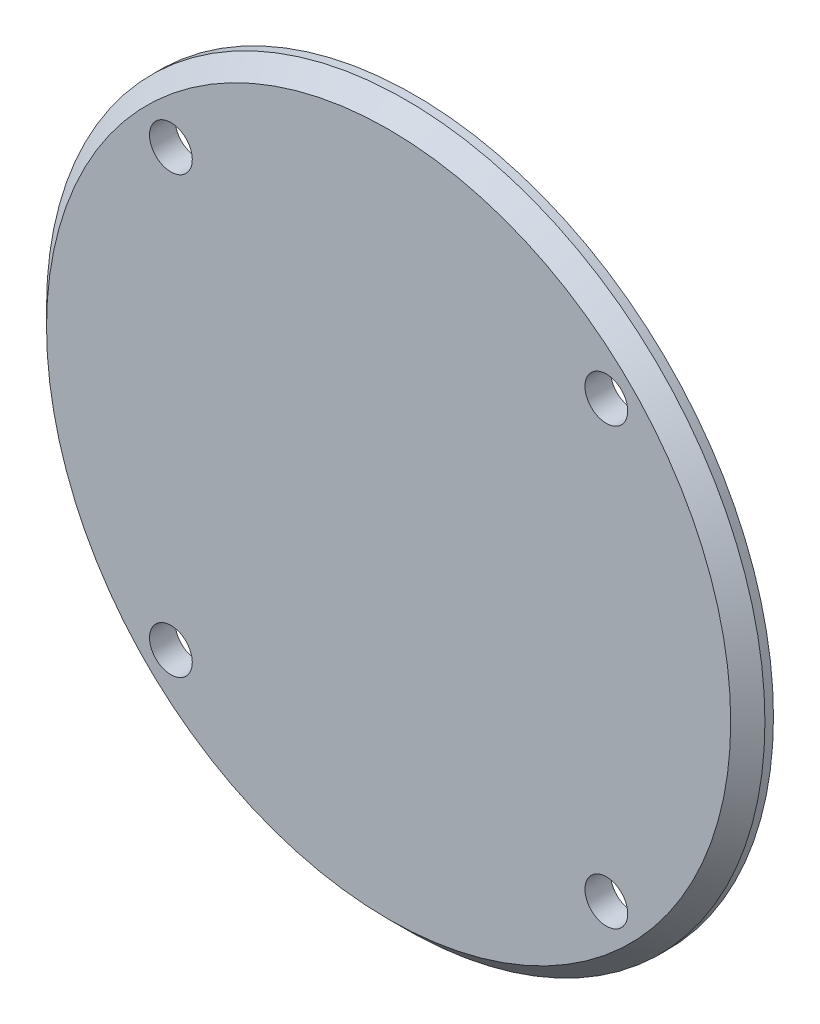
ISO-10303-21;
HEADER;
FILE_DESCRIPTION(('STEP AP214'),'2;1');
FILE_NAME('part.step','',(''),(''),'','','');
FILE_SCHEMA(('AUTOMOTIVE_DESIGN { 1 0 10303 214 1 1 1 1 }'));
ENDSEC;
DATA;
#1=APPLICATION_CONTEXT('core data for automotive mechanical design processes');
#2=APPLICATION_PROTOCOL_DEFINITION('international standard','automotive_design',2000,#1);
#3=PRODUCT_CONTEXT('',#1,'mechanical');
#4=PRODUCT('Part','Part','',(#3));
#5=PRODUCT_RELATED_PRODUCT_CATEGORY('part','',(#4));
#6=PRODUCT_DEFINITION_FORMATION('','',#4);
#7=PRODUCT_DEFINITION_CONTEXT('part definition',#1,'design');
#8=PRODUCT_DEFINITION('design','',#6,#7);
#9=PRODUCT_DEFINITION_SHAPE('','',#8);
#10=(LENGTH_UNIT() NAMED_UNIT(*) SI_UNIT(.MILLI.,.METRE.));
#11=(NAMED_UNIT(*) PLANE_ANGLE_UNIT() SI_UNIT($,.RADIAN.));
#12=(NAMED_UNIT(*) SI_UNIT($,.STERADIAN.) SOLID_ANGLE_UNIT());
#13=UNCERTAINTY_MEASURE_WITH_UNIT(LENGTH_MEASURE(1.E-05),#10,'distance_accuracy_value','');
#14=(GEOMETRIC_REPRESENTATION_CONTEXT(3) GLOBAL_UNCERTAINTY_ASSIGNED_CONTEXT((#13)) GLOBAL_UNIT_ASSIGNED_CONTEXT((#10,
#11,#12)) REPRESENTATION_CONTEXT('',''));
#15=CARTESIAN_POINT('',(0.,0.,0.));
#16=DIRECTION('',(0.,0.,1.));
#17=DIRECTION('',(1.,0.,0.));
#18=AXIS2_PLACEMENT_3D('',#15,#16,#17);
#19=CARTESIAN_POINT('',(0.,0.,143.95));
#20=DIRECTION('',(0.,0.,-1.));
#21=DIRECTION('',(-1.,0.,0.));
#22=AXIS2_PLACEMENT_3D('',#19,#20,#21);
#23=CYLINDRICAL_SURFACE('',#22,42.);
#24=CARTESIAN_POINT('',(0.,0.,141.95));
#25=DIRECTION('',(0.,0.,1.));
#26=DIRECTION('',(1.,0.,0.));
#27=AXIS2_PLACEMENT_3D('',#24,#25,#26);
#28=CIRCLE('',#27,42.);
#29=CARTESIAN_POINT('',(42.,0.,141.95));
#30=VERTEX_POINT('',#29);
#31=EDGE_CURVE('E10',#30,#30,#28,.F.);
#32=ORIENTED_EDGE('',*,*,#31,.T.);
#33=EDGE_LOOP('',(#32));
#34=FACE_BOUND('',#33,.T.);
#35=CARTESIAN_POINT('',(0.,0.,140.95));
#36=DIRECTION('',(0.,0.,1.));
#37=DIRECTION('',(1.,0.,0.));
#38=AXIS2_PLACEMENT_3D('',#35,#36,#37);
#39=CIRCLE('',#38,42.);
#40=CARTESIAN_POINT('',(42.,0.,140.95));
#41=VERTEX_POINT('',#40);
#42=EDGE_CURVE('E46',#41,#41,#39,.T.);
#43=ORIENTED_EDGE('',*,*,#42,.T.);
#44=EDGE_LOOP('',(#43));
#45=FACE_BOUND('',#44,.T.);
#46=ADVANCED_FACE('F34',(#34,#45),#23,.T.);
#47=CARTESIAN_POINT('',(0.,0.,143.95));
#48=DIRECTION('',(0.,0.,1.));
#49=DIRECTION('',(1.,0.,0.));
#50=AXIS2_PLACEMENT_3D('',#47,#48,#49);
#51=PLANE('',#50);
#52=CARTESIAN_POINT('',(0.,0.,143.95));
#53=DIRECTION('',(0.,0.,1.));
#54=DIRECTION('',(1.,0.,0.));
#55=AXIS2_PLACEMENT_3D('',#52,#53,#54);
#56=CIRCLE('',#55,40.);
#57=CARTESIAN_POINT('',(40.,0.,143.95));
#58=VERTEX_POINT('',#57);
#59=EDGE_CURVE('E42',#58,#58,#56,.T.);
#60=ORIENTED_EDGE('',*,*,#59,.T.);
#61=EDGE_LOOP('',(#60));
#62=FACE_BOUND('',#61,.T.);
#63=CARTESIAN_POINT('',(-25.4558441227155,25.4558441227159,143.95));
#64=DIRECTION('',(0.,0.,1.));
#65=DIRECTION('',(0.,-1.,0.));
#66=AXIS2_PLACEMENT_3D('',#63,#64,#65);
#67=CIRCLE('',#66,2.5);
#68=CARTESIAN_POINT('',(-25.4558441227155,22.9558441227159,143.95));
#69=VERTEX_POINT('',#68);
#70=EDGE_CURVE('E69',#69,#69,#67,.T.);
#71=ORIENTED_EDGE('',*,*,#70,.F.);
#72=EDGE_LOOP('',(#71));
#73=FACE_BOUND('',#72,.T.);
#74=CARTESIAN_POINT('',(25.4558441227158,25.4558441227156,143.95));
#75=DIRECTION('',(0.,0.,1.));
#76=DIRECTION('',(-1.,0.,0.));
#77=AXIS2_PLACEMENT_3D('',#74,#75,#76);
#78=CIRCLE('',#77,2.5);
#79=CARTESIAN_POINT('',(22.9558441227158,25.4558441227156,143.95));
#80=VERTEX_POINT('',#79);
#81=EDGE_CURVE('E62',#80,#80,#78,.T.);
#82=ORIENTED_EDGE('',*,*,#81,.F.);
#83=EDGE_LOOP('',(#82));
#84=FACE_BOUND('',#83,.T.);
#85=CARTESIAN_POINT('',(25.4558441227153,-25.4558441227161,143.95));
#86=DIRECTION('',(0.,0.,1.));
#87=DIRECTION('',(0.,1.,0.));
#88=AXIS2_PLACEMENT_3D('',#85,#86,#87);
#89=CIRCLE('',#88,2.5);
#90=CARTESIAN_POINT('',(25.4558441227153,-22.9558441227161,143.95));
#91=VERTEX_POINT('',#90);
#92=EDGE_CURVE('E63',#91,#91,#89,.T.);
#93=ORIENTED_EDGE('',*,*,#92,.F.);
#94=EDGE_LOOP('',(#93));
#95=FACE_BOUND('',#94,.T.);
#96=CARTESIAN_POINT('',(-25.4558441227158,-25.4558441227156,143.95));
#97=DIRECTION('',(0.,0.,1.));
#98=DIRECTION('',(1.,0.,0.));
#99=AXIS2_PLACEMENT_3D('',#96,#97,#98);
#100=CIRCLE('',#99,2.5);
#101=CARTESIAN_POINT('',(-22.9558441227158,-25.4558441227156,143.95));
#102=VERTEX_POINT('',#101);
#103=EDGE_CURVE('E54',#102,#102,#100,.T.);
#104=ORIENTED_EDGE('',*,*,#103,.F.);
#105=EDGE_LOOP('',(#104));
#106=FACE_BOUND('',#105,.T.);
#107=ADVANCED_FACE('F80',(#62,#73,#84,#95,#106),#51,.T.);
#108=CARTESIAN_POINT('',(0.,0.,140.95));
#109=DIRECTION('',(0.,0.,1.));
#110=DIRECTION('',(1.,0.,0.));
#111=AXIS2_PLACEMENT_3D('',#108,#109,#110);
#112=PLANE('',#111);
#113=CARTESIAN_POINT('',(-25.4558441227155,25.4558441227159,140.95));
#114=DIRECTION('',(0.,0.,1.));
#115=DIRECTION('',(0.,-1.,0.));
#116=AXIS2_PLACEMENT_3D('',#113,#114,#115);
#117=CIRCLE('',#116,2.5);
#118=CARTESIAN_POINT('',(-25.4558441227155,22.9558441227159,140.95));
#119=VERTEX_POINT('',#118);
#120=EDGE_CURVE('E58',#119,#119,#117,.F.);
#121=ORIENTED_EDGE('',*,*,#120,.F.);
#122=EDGE_LOOP('',(#121));
#123=FACE_BOUND('',#122,.T.);
#124=CARTESIAN_POINT('',(25.4558441227158,25.4558441227156,140.95));
#125=DIRECTION('',(0.,0.,1.));
#126=DIRECTION('',(-1.,0.,0.));
#127=AXIS2_PLACEMENT_3D('',#124,#125,#126);
#128=CIRCLE('',#127,2.5);
#129=CARTESIAN_POINT('',(22.9558441227158,25.4558441227156,140.95));
#130=VERTEX_POINT('',#129);
#131=EDGE_CURVE('E66',#130,#130,#128,.F.);
#132=ORIENTED_EDGE('',*,*,#131,.F.);
#133=EDGE_LOOP('',(#132));
#134=FACE_BOUND('',#133,.T.);
#135=CARTESIAN_POINT('',(25.4558441227153,-25.4558441227161,140.95));
#136=DIRECTION('',(0.,0.,1.));
#137=DIRECTION('',(0.,1.,0.));
#138=AXIS2_PLACEMENT_3D('',#135,#136,#137);
#139=CIRCLE('',#138,2.5);
#140=CARTESIAN_POINT('',(25.4558441227153,-22.9558441227161,140.95));
#141=VERTEX_POINT('',#140);
#142=EDGE_CURVE('E59',#141,#141,#139,.F.);
#143=ORIENTED_EDGE('',*,*,#142,.F.);
#144=EDGE_LOOP('',(#143));
#145=FACE_BOUND('',#144,.T.);
#146=CARTESIAN_POINT('',(-25.4558441227158,-25.4558441227156,140.95));
#147=DIRECTION('',(0.,0.,1.));
#148=DIRECTION('',(1.,0.,0.));
#149=AXIS2_PLACEMENT_3D('',#146,#147,#148);
#150=CIRCLE('',#149,2.5);
#151=CARTESIAN_POINT('',(-22.9558441227158,-25.4558441227156,140.95));
#152=VERTEX_POINT('',#151);
#153=EDGE_CURVE('E50',#152,#152,#150,.F.);
#154=ORIENTED_EDGE('',*,*,#153,.F.);
#155=EDGE_LOOP('',(#154));
#156=FACE_BOUND('',#155,.T.);
#157=ORIENTED_EDGE('',*,*,#42,.F.);
#158=EDGE_LOOP('',(#157));
#159=FACE_BOUND('',#158,.T.);
#160=ADVANCED_FACE('F83',(#123,#134,#145,#156,#159),#112,.F.);
#161=CARTESIAN_POINT('',(-25.4558441227158,-25.4558441227156,143.95));
#162=DIRECTION('',(0.,0.,-1.));
#163=DIRECTION('',(-1.,0.,0.));
#164=AXIS2_PLACEMENT_3D('',#161,#162,#163);
#165=CYLINDRICAL_SURFACE('',#164,2.5);
#166=ORIENTED_EDGE('',*,*,#103,.T.);
#167=EDGE_LOOP('',(#166));
#168=FACE_BOUND('',#167,.T.);
#169=ORIENTED_EDGE('',*,*,#153,.T.);
#170=EDGE_LOOP('',(#169));
#171=FACE_BOUND('',#170,.T.);
#172=ADVANCED_FACE('F91',(#168,#171),#165,.F.);
#173=CARTESIAN_POINT('',(25.4558441227153,-25.4558441227161,143.95));
#174=DIRECTION('',(0.,0.,-1.));
#175=DIRECTION('',(0.,-1.,0.));
#176=AXIS2_PLACEMENT_3D('',#173,#174,#175);
#177=CYLINDRICAL_SURFACE('',#176,2.5);
#178=ORIENTED_EDGE('',*,*,#92,.T.);
#179=EDGE_LOOP('',(#178));
#180=FACE_BOUND('',#179,.T.);
#181=ORIENTED_EDGE('',*,*,#142,.T.);
#182=EDGE_LOOP('',(#181));
#183=FACE_BOUND('',#182,.T.);
#184=ADVANCED_FACE('F94',(#180,#183),#177,.F.);
#185=CARTESIAN_POINT('',(25.4558441227158,25.4558441227156,143.95));
#186=DIRECTION('',(0.,0.,-1.));
#187=DIRECTION('',(1.,0.,0.));
#188=AXIS2_PLACEMENT_3D('',#185,#186,#187);
#189=CYLINDRICAL_SURFACE('',#188,2.5);
#190=ORIENTED_EDGE('',*,*,#81,.T.);
#191=EDGE_LOOP('',(#190));
#192=FACE_BOUND('',#191,.T.);
#193=ORIENTED_EDGE('',*,*,#131,.T.);
#194=EDGE_LOOP('',(#193));
#195=FACE_BOUND('',#194,.T.);
#196=ADVANCED_FACE('F110',(#192,#195),#189,.F.);
#197=CARTESIAN_POINT('',(-25.4558441227155,25.4558441227159,143.95));
#198=DIRECTION('',(0.,0.,-1.));
#199=DIRECTION('',(0.,1.,0.));
#200=AXIS2_PLACEMENT_3D('',#197,#198,#199);
#201=CYLINDRICAL_SURFACE('',#200,2.5);
#202=ORIENTED_EDGE('',*,*,#70,.T.);
#203=EDGE_LOOP('',(#202));
#204=FACE_BOUND('',#203,.T.);
#205=ORIENTED_EDGE('',*,*,#120,.T.);
#206=EDGE_LOOP('',(#205));
#207=FACE_BOUND('',#206,.T.);
#208=ADVANCED_FACE('F77',(#204,#207),#201,.F.);
#209=CARTESIAN_POINT('',(0.,0.,143.95));
#210=DIRECTION('',(0.,0.,-1.));
#211=DIRECTION('',(-1.,0.,0.));
#212=AXIS2_PLACEMENT_3D('',#209,#210,#211);
#213=CONICAL_SURFACE('',#212,40.,0.785398163397453);
#214=ORIENTED_EDGE('',*,*,#31,.F.);
#215=EDGE_LOOP('',(#214));
#216=FACE_BOUND('',#215,.T.);
#217=ORIENTED_EDGE('',*,*,#59,.F.);
#218=EDGE_LOOP('',(#217));
#219=FACE_BOUND('',#218,.T.);
#220=ADVANCED_FACE('F37',(#216,#219),#213,.T.);
#221=CLOSED_SHELL('',(#46,#107,#160,#172,#184,#196,#208,#220));
#222=MANIFOLD_SOLID_BREP('B2',#221);
#223=ADVANCED_BREP_SHAPE_REPRESENTATION('',(#18,#222),#14);
#224=SHAPE_DEFINITION_REPRESENTATION(#9,#223);
ENDSEC;
END-ISO-10303-21;
